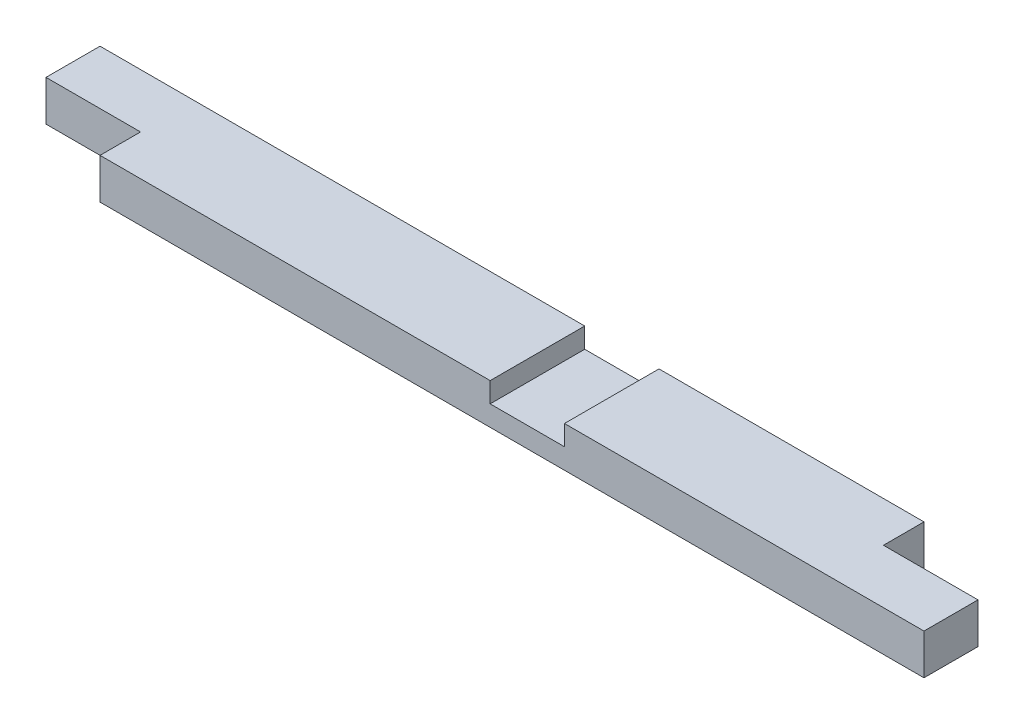
ISO-10303-21;
HEADER;
FILE_DESCRIPTION(('STEP AP214'),'2;1');
FILE_NAME('part.step','',(''),(''),'','','');
FILE_SCHEMA(('AUTOMOTIVE_DESIGN { 1 0 10303 214 1 1 1 1 }'));
ENDSEC;
DATA;
#1=APPLICATION_CONTEXT('core data for automotive mechanical design processes');
#2=APPLICATION_PROTOCOL_DEFINITION('international standard','automotive_design',2000,#1);
#3=PRODUCT_CONTEXT('',#1,'mechanical');
#4=PRODUCT('Part','Part','',(#3));
#5=PRODUCT_RELATED_PRODUCT_CATEGORY('part','',(#4));
#6=PRODUCT_DEFINITION_FORMATION('','',#4);
#7=PRODUCT_DEFINITION_CONTEXT('part definition',#1,'design');
#8=PRODUCT_DEFINITION('design','',#6,#7);
#9=PRODUCT_DEFINITION_SHAPE('','',#8);
#10=(LENGTH_UNIT() NAMED_UNIT(*) SI_UNIT(.MILLI.,.METRE.));
#11=(NAMED_UNIT(*) PLANE_ANGLE_UNIT() SI_UNIT($,.RADIAN.));
#12=(NAMED_UNIT(*) SI_UNIT($,.STERADIAN.) SOLID_ANGLE_UNIT());
#13=UNCERTAINTY_MEASURE_WITH_UNIT(LENGTH_MEASURE(1.E-05),#10,'distance_accuracy_value','');
#14=(GEOMETRIC_REPRESENTATION_CONTEXT(3) GLOBAL_UNCERTAINTY_ASSIGNED_CONTEXT((#13)) GLOBAL_UNIT_ASSIGNED_CONTEXT((#10,
#11,#12)) REPRESENTATION_CONTEXT('',''));
#15=CARTESIAN_POINT('',(0.,0.,0.));
#16=DIRECTION('',(0.,0.,1.));
#17=DIRECTION('',(1.,0.,0.));
#18=AXIS2_PLACEMENT_3D('',#15,#16,#17);
#19=CARTESIAN_POINT('',(0.,38.1,0.));
#20=DIRECTION('',(0.,-1.,0.));
#21=DIRECTION('',(0.,0.,-1.));
#22=AXIS2_PLACEMENT_3D('',#19,#20,#21);
#23=PLANE('',#22);
#24=DIRECTION('',(-1.,0.,0.));
#25=VECTOR('',#24,1.);
#26=CARTESIAN_POINT('',(0.,38.1,-88.9));
#27=LINE('',#26,#25);
#28=CARTESIAN_POINT('',(774.7,38.1,-88.9));
#29=VERTEX_POINT('',#28);
#30=CARTESIAN_POINT('',(525.573634290706,38.1,-88.9));
#31=VERTEX_POINT('',#30);
#32=EDGE_CURVE('E213',#29,#31,#27,.T.);
#33=ORIENTED_EDGE('',*,*,#32,.T.);
#34=DIRECTION('',(0.,0.,-1.));
#35=VECTOR('',#34,1.);
#36=CARTESIAN_POINT('',(525.573634290706,38.1,0.));
#37=LINE('',#36,#35);
#38=CARTESIAN_POINT('',(525.573634290706,38.1,0.));
#39=VERTEX_POINT('',#38);
#40=EDGE_CURVE('E162',#39,#31,#37,.T.);
#41=ORIENTED_EDGE('',*,*,#40,.F.);
#42=DIRECTION('',(1.,0.,0.));
#43=VECTOR('',#42,1.);
#44=CARTESIAN_POINT('',(0.,38.1,0.));
#45=LINE('',#44,#43);
#46=CARTESIAN_POINT('',(863.6,38.1,0.));
#47=VERTEX_POINT('',#46);
#48=EDGE_CURVE('E154',#39,#47,#45,.T.);
#49=ORIENTED_EDGE('',*,*,#48,.T.);
#50=DIRECTION('',(0.,0.,-1.));
#51=VECTOR('',#50,1.);
#52=CARTESIAN_POINT('',(863.6,38.1,0.));
#53=LINE('',#52,#51);
#54=CARTESIAN_POINT('',(863.6,38.1,-50.8));
#55=VERTEX_POINT('',#54);
#56=EDGE_CURVE('E209',#47,#55,#53,.T.);
#57=ORIENTED_EDGE('',*,*,#56,.T.);
#58=DIRECTION('',(-1.,0.,0.));
#59=VECTOR('',#58,1.);
#60=CARTESIAN_POINT('',(863.6,38.1,-50.8));
#61=LINE('',#60,#59);
#62=CARTESIAN_POINT('',(774.7,38.1,-50.8));
#63=VERTEX_POINT('',#62);
#64=EDGE_CURVE('E168',#55,#63,#61,.T.);
#65=ORIENTED_EDGE('',*,*,#64,.T.);
#66=DIRECTION('',(0.,0.,-1.));
#67=VECTOR('',#66,1.);
#68=CARTESIAN_POINT('',(774.7,38.1,-88.9));
#69=LINE('',#68,#67);
#70=EDGE_CURVE('E171',#63,#29,#69,.T.);
#71=ORIENTED_EDGE('',*,*,#70,.T.);
#72=EDGE_LOOP('',(#33,#41,#49,#57,#65,#71));
#73=FACE_BOUND('',#72,.T.);
#74=ADVANCED_FACE('F41',(#73),#23,.F.);
#75=CARTESIAN_POINT('',(0.,38.1,0.));
#76=DIRECTION('',(1.,0.,0.));
#77=DIRECTION('',(0.,0.,-1.));
#78=AXIS2_PLACEMENT_3D('',#75,#76,#77);
#79=PLANE('',#78);
#80=DIRECTION('',(0.,0.,1.));
#81=VECTOR('',#80,1.);
#82=CARTESIAN_POINT('',(0.,0.,0.));
#83=LINE('',#82,#81);
#84=CARTESIAN_POINT('',(0.,0.,-88.9));
#85=VERTEX_POINT('',#84);
#86=CARTESIAN_POINT('',(0.,0.,-38.1));
#87=VERTEX_POINT('',#86);
#88=EDGE_CURVE('E198',#85,#87,#83,.T.);
#89=ORIENTED_EDGE('',*,*,#88,.T.);
#90=DIRECTION('',(0.,1.,0.));
#91=VECTOR('',#90,1.);
#92=CARTESIAN_POINT('',(0.,0.,-38.1));
#93=LINE('',#92,#91);
#94=CARTESIAN_POINT('',(0.,38.1,-38.1));
#95=VERTEX_POINT('',#94);
#96=EDGE_CURVE('E195',#87,#95,#93,.T.);
#97=ORIENTED_EDGE('',*,*,#96,.T.);
#98=DIRECTION('',(0.,0.,1.));
#99=VECTOR('',#98,1.);
#100=CARTESIAN_POINT('',(0.,38.1,0.));
#101=LINE('',#100,#99);
#102=CARTESIAN_POINT('',(0.,38.1,-88.9));
#103=VERTEX_POINT('',#102);
#104=EDGE_CURVE('E202',#103,#95,#101,.T.);
#105=ORIENTED_EDGE('',*,*,#104,.F.);
#106=DIRECTION('',(0.,-1.,0.));
#107=VECTOR('',#106,1.);
#108=CARTESIAN_POINT('',(0.,38.1,-88.9));
#109=LINE('',#108,#107);
#110=EDGE_CURVE('E49',#103,#85,#109,.T.);
#111=ORIENTED_EDGE('',*,*,#110,.T.);
#112=EDGE_LOOP('',(#89,#97,#105,#111));
#113=FACE_BOUND('',#112,.T.);
#114=ADVANCED_FACE('F43',(#113),#79,.F.);
#115=CARTESIAN_POINT('',(0.,38.1,0.));
#116=DIRECTION('',(0.,0.,-1.));
#117=DIRECTION('',(-1.,0.,0.));
#118=AXIS2_PLACEMENT_3D('',#115,#116,#117);
#119=PLANE('',#118);
#120=ORIENTED_EDGE('',*,*,#48,.F.);
#121=DIRECTION('',(0.,-1.,0.));
#122=VECTOR('',#121,1.);
#123=CARTESIAN_POINT('',(525.573634290706,19.1544963612102,0.));
#124=LINE('',#123,#122);
#125=CARTESIAN_POINT('',(525.573634290706,19.1544963612102,0.));
#126=VERTEX_POINT('',#125);
#127=EDGE_CURVE('E134',#39,#126,#124,.T.);
#128=ORIENTED_EDGE('',*,*,#127,.T.);
#129=DIRECTION('',(-1.,0.,0.));
#130=VECTOR('',#129,1.);
#131=CARTESIAN_POINT('',(525.573634290706,19.1544963612102,0.));
#132=LINE('',#131,#130);
#133=CARTESIAN_POINT('',(455.723634290706,19.1544963612102,0.));
#134=VERTEX_POINT('',#133);
#135=EDGE_CURVE('E145',#126,#134,#132,.T.);
#136=ORIENTED_EDGE('',*,*,#135,.T.);
#137=DIRECTION('',(0.,1.,0.));
#138=VECTOR('',#137,1.);
#139=CARTESIAN_POINT('',(455.723634290706,19.1544963612102,0.));
#140=LINE('',#139,#138);
#141=CARTESIAN_POINT('',(455.723634290706,38.1,0.));
#142=VERTEX_POINT('',#141);
#143=EDGE_CURVE('E142',#134,#142,#140,.T.);
#144=ORIENTED_EDGE('',*,*,#143,.T.);
#145=CARTESIAN_POINT('',(88.9,38.1,0.));
#146=VERTEX_POINT('',#145);
#147=EDGE_CURVE('E206',#146,#142,#45,.T.);
#148=ORIENTED_EDGE('',*,*,#147,.F.);
#149=DIRECTION('',(0.,1.,0.));
#150=VECTOR('',#149,1.);
#151=CARTESIAN_POINT('',(88.9,0.,0.));
#152=LINE('',#151,#150);
#153=CARTESIAN_POINT('',(88.9,0.,0.));
#154=VERTEX_POINT('',#153);
#155=EDGE_CURVE('E191',#154,#146,#152,.T.);
#156=ORIENTED_EDGE('',*,*,#155,.F.);
#157=DIRECTION('',(1.,0.,0.));
#158=VECTOR('',#157,1.);
#159=CARTESIAN_POINT('',(0.,0.,0.));
#160=LINE('',#159,#158);
#161=CARTESIAN_POINT('',(863.6,0.,0.));
#162=VERTEX_POINT('',#161);
#163=EDGE_CURVE('E218',#154,#162,#160,.T.);
#164=ORIENTED_EDGE('',*,*,#163,.T.);
#165=DIRECTION('',(0.,-1.,0.));
#166=VECTOR('',#165,1.);
#167=CARTESIAN_POINT('',(863.6,38.1,0.));
#168=LINE('',#167,#166);
#169=EDGE_CURVE('E11',#47,#162,#168,.T.);
#170=ORIENTED_EDGE('',*,*,#169,.F.);
#171=EDGE_LOOP('',(#120,#128,#136,#144,#148,#156,#164,#170));
#172=FACE_BOUND('',#171,.T.);
#173=ADVANCED_FACE('F152',(#172),#119,.F.);
#174=CARTESIAN_POINT('',(863.6,38.1,0.));
#175=DIRECTION('',(-1.,0.,0.));
#176=DIRECTION('',(0.,0.,1.));
#177=AXIS2_PLACEMENT_3D('',#174,#175,#176);
#178=PLANE('',#177);
#179=DIRECTION('',(0.,0.,-1.));
#180=VECTOR('',#179,1.);
#181=CARTESIAN_POINT('',(863.6,0.,0.));
#182=LINE('',#181,#180);
#183=CARTESIAN_POINT('',(863.6,0.,-50.8));
#184=VERTEX_POINT('',#183);
#185=EDGE_CURVE('E220',#162,#184,#182,.T.);
#186=ORIENTED_EDGE('',*,*,#185,.T.);
#187=DIRECTION('',(0.,-1.,0.));
#188=VECTOR('',#187,1.);
#189=CARTESIAN_POINT('',(863.6,38.1,-50.8));
#190=LINE('',#189,#188);
#191=EDGE_CURVE('E64',#55,#184,#190,.T.);
#192=ORIENTED_EDGE('',*,*,#191,.F.);
#193=ORIENTED_EDGE('',*,*,#56,.F.);
#194=ORIENTED_EDGE('',*,*,#169,.T.);
#195=EDGE_LOOP('',(#186,#192,#193,#194));
#196=FACE_BOUND('',#195,.T.);
#197=ADVANCED_FACE('F254',(#196),#178,.F.);
#198=CARTESIAN_POINT('',(0.,38.1,-88.9));
#199=DIRECTION('',(0.,0.,1.));
#200=DIRECTION('',(1.,0.,0.));
#201=AXIS2_PLACEMENT_3D('',#198,#199,#200);
#202=PLANE('',#201);
#203=DIRECTION('',(-1.,0.,0.));
#204=VECTOR('',#203,1.);
#205=CARTESIAN_POINT('',(525.573634290706,19.1544963612102,-88.9));
#206=LINE('',#205,#204);
#207=CARTESIAN_POINT('',(525.573634290706,19.1544963612102,-88.9));
#208=VERTEX_POINT('',#207);
#209=CARTESIAN_POINT('',(455.723634290706,19.1544963612102,-88.9));
#210=VERTEX_POINT('',#209);
#211=EDGE_CURVE('E156',#208,#210,#206,.T.);
#212=ORIENTED_EDGE('',*,*,#211,.F.);
#213=DIRECTION('',(0.,-1.,0.));
#214=VECTOR('',#213,1.);
#215=CARTESIAN_POINT('',(525.573634290706,19.1544963612102,-88.9));
#216=LINE('',#215,#214);
#217=EDGE_CURVE('E137',#31,#208,#216,.T.);
#218=ORIENTED_EDGE('',*,*,#217,.F.);
#219=ORIENTED_EDGE('',*,*,#32,.F.);
#220=DIRECTION('',(0.,-1.,0.));
#221=VECTOR('',#220,1.);
#222=CARTESIAN_POINT('',(774.7,38.1,-88.9));
#223=LINE('',#222,#221);
#224=CARTESIAN_POINT('',(774.7,0.,-88.9));
#225=VERTEX_POINT('',#224);
#226=EDGE_CURVE('E177',#29,#225,#223,.T.);
#227=ORIENTED_EDGE('',*,*,#226,.T.);
#228=DIRECTION('',(-1.,0.,0.));
#229=VECTOR('',#228,1.);
#230=CARTESIAN_POINT('',(0.,0.,-88.9));
#231=LINE('',#230,#229);
#232=EDGE_CURVE('E205',#225,#85,#231,.T.);
#233=ORIENTED_EDGE('',*,*,#232,.T.);
#234=ORIENTED_EDGE('',*,*,#110,.F.);
#235=CARTESIAN_POINT('',(455.723634290706,38.1,-88.9));
#236=VERTEX_POINT('',#235);
#237=EDGE_CURVE('E212',#236,#103,#27,.T.);
#238=ORIENTED_EDGE('',*,*,#237,.F.);
#239=DIRECTION('',(0.,1.,0.));
#240=VECTOR('',#239,1.);
#241=CARTESIAN_POINT('',(455.723634290706,19.1544963612102,-88.9));
#242=LINE('',#241,#240);
#243=EDGE_CURVE('E56',#210,#236,#242,.T.);
#244=ORIENTED_EDGE('',*,*,#243,.F.);
#245=EDGE_LOOP('',(#212,#218,#219,#227,#233,#234,#238,#244));
#246=FACE_BOUND('',#245,.T.);
#247=ADVANCED_FACE('F246',(#246),#202,.F.);
#248=ORIENTED_EDGE('',*,*,#147,.T.);
#249=DIRECTION('',(0.,0.,-1.));
#250=VECTOR('',#249,1.);
#251=CARTESIAN_POINT('',(455.723634290706,38.1,0.));
#252=LINE('',#251,#250);
#253=EDGE_CURVE('E165',#142,#236,#252,.T.);
#254=ORIENTED_EDGE('',*,*,#253,.T.);
#255=ORIENTED_EDGE('',*,*,#237,.T.);
#256=ORIENTED_EDGE('',*,*,#104,.T.);
#257=DIRECTION('',(-1.,0.,0.));
#258=VECTOR('',#257,1.);
#259=CARTESIAN_POINT('',(0.,38.1,-38.1));
#260=LINE('',#259,#258);
#261=CARTESIAN_POINT('',(88.9,38.1,-38.1));
#262=VERTEX_POINT('',#261);
#263=EDGE_CURVE('E188',#262,#95,#260,.T.);
#264=ORIENTED_EDGE('',*,*,#263,.F.);
#265=DIRECTION('',(0.,0.,-1.));
#266=VECTOR('',#265,1.);
#267=CARTESIAN_POINT('',(88.9,38.1,0.));
#268=LINE('',#267,#266);
#269=EDGE_CURVE('E180',#146,#262,#268,.T.);
#270=ORIENTED_EDGE('',*,*,#269,.F.);
#271=EDGE_LOOP('',(#248,#254,#255,#256,#264,#270));
#272=FACE_BOUND('',#271,.T.);
#273=ADVANCED_FACE('F245',(#272),#23,.F.);
#274=CARTESIAN_POINT('',(0.,0.,0.));
#275=DIRECTION('',(0.,-1.,0.));
#276=DIRECTION('',(0.,0.,-1.));
#277=AXIS2_PLACEMENT_3D('',#274,#275,#276);
#278=PLANE('',#277);
#279=DIRECTION('',(0.,0.,-1.));
#280=VECTOR('',#279,1.);
#281=CARTESIAN_POINT('',(774.7,0.,-88.9));
#282=LINE('',#281,#280);
#283=CARTESIAN_POINT('',(774.7,0.,-50.8));
#284=VERTEX_POINT('',#283);
#285=EDGE_CURVE('E172',#284,#225,#282,.T.);
#286=ORIENTED_EDGE('',*,*,#285,.F.);
#287=DIRECTION('',(-1.,0.,0.));
#288=VECTOR('',#287,1.);
#289=CARTESIAN_POINT('',(863.6,0.,-50.8));
#290=LINE('',#289,#288);
#291=EDGE_CURVE('E164',#184,#284,#290,.T.);
#292=ORIENTED_EDGE('',*,*,#291,.F.);
#293=ORIENTED_EDGE('',*,*,#185,.F.);
#294=ORIENTED_EDGE('',*,*,#163,.F.);
#295=DIRECTION('',(0.,0.,-1.));
#296=VECTOR('',#295,1.);
#297=CARTESIAN_POINT('',(88.9,0.,0.));
#298=LINE('',#297,#296);
#299=CARTESIAN_POINT('',(88.9,0.,-38.1));
#300=VERTEX_POINT('',#299);
#301=EDGE_CURVE('E184',#154,#300,#298,.T.);
#302=ORIENTED_EDGE('',*,*,#301,.T.);
#303=DIRECTION('',(-1.,0.,0.));
#304=VECTOR('',#303,1.);
#305=CARTESIAN_POINT('',(0.,0.,-38.1));
#306=LINE('',#305,#304);
#307=EDGE_CURVE('E187',#300,#87,#306,.T.);
#308=ORIENTED_EDGE('',*,*,#307,.T.);
#309=ORIENTED_EDGE('',*,*,#88,.F.);
#310=ORIENTED_EDGE('',*,*,#232,.F.);
#311=EDGE_LOOP('',(#286,#292,#293,#294,#302,#308,#309,#310));
#312=FACE_BOUND('',#311,.T.);
#313=ADVANCED_FACE('F233',(#312),#278,.T.);
#314=CARTESIAN_POINT('',(0.,0.,-38.1));
#315=DIRECTION('',(0.,0.,-1.));
#316=DIRECTION('',(-1.,0.,0.));
#317=AXIS2_PLACEMENT_3D('',#314,#315,#316);
#318=PLANE('',#317);
#319=ORIENTED_EDGE('',*,*,#263,.T.);
#320=ORIENTED_EDGE('',*,*,#96,.F.);
#321=ORIENTED_EDGE('',*,*,#307,.F.);
#322=DIRECTION('',(0.,1.,0.));
#323=VECTOR('',#322,1.);
#324=CARTESIAN_POINT('',(88.9,0.,-38.1));
#325=LINE('',#324,#323);
#326=EDGE_CURVE('E199',#300,#262,#325,.T.);
#327=ORIENTED_EDGE('',*,*,#326,.T.);
#328=EDGE_LOOP('',(#319,#320,#321,#327));
#329=FACE_BOUND('',#328,.T.);
#330=ADVANCED_FACE('F237',(#329),#318,.F.);
#331=CARTESIAN_POINT('',(88.9,0.,0.));
#332=DIRECTION('',(1.,0.,0.));
#333=DIRECTION('',(0.,0.,-1.));
#334=AXIS2_PLACEMENT_3D('',#331,#332,#333);
#335=PLANE('',#334);
#336=ORIENTED_EDGE('',*,*,#269,.T.);
#337=ORIENTED_EDGE('',*,*,#326,.F.);
#338=ORIENTED_EDGE('',*,*,#301,.F.);
#339=ORIENTED_EDGE('',*,*,#155,.T.);
#340=EDGE_LOOP('',(#336,#337,#338,#339));
#341=FACE_BOUND('',#340,.T.);
#342=ADVANCED_FACE('F239',(#341),#335,.F.);
#343=CARTESIAN_POINT('',(774.7,38.1,-88.9));
#344=DIRECTION('',(-1.,0.,0.));
#345=DIRECTION('',(0.,0.,1.));
#346=AXIS2_PLACEMENT_3D('',#343,#344,#345);
#347=PLANE('',#346);
#348=ORIENTED_EDGE('',*,*,#285,.T.);
#349=ORIENTED_EDGE('',*,*,#226,.F.);
#350=ORIENTED_EDGE('',*,*,#70,.F.);
#351=DIRECTION('',(0.,-1.,0.));
#352=VECTOR('',#351,1.);
#353=CARTESIAN_POINT('',(774.7,38.1,-50.8));
#354=LINE('',#353,#352);
#355=EDGE_CURVE('E181',#63,#284,#354,.T.);
#356=ORIENTED_EDGE('',*,*,#355,.T.);
#357=EDGE_LOOP('',(#348,#349,#350,#356));
#358=FACE_BOUND('',#357,.T.);
#359=ADVANCED_FACE('F251',(#358),#347,.F.);
#360=CARTESIAN_POINT('',(863.6,38.1,-50.8));
#361=DIRECTION('',(0.,0.,1.));
#362=DIRECTION('',(1.,0.,0.));
#363=AXIS2_PLACEMENT_3D('',#360,#361,#362);
#364=PLANE('',#363);
#365=ORIENTED_EDGE('',*,*,#291,.T.);
#366=ORIENTED_EDGE('',*,*,#355,.F.);
#367=ORIENTED_EDGE('',*,*,#64,.F.);
#368=ORIENTED_EDGE('',*,*,#191,.T.);
#369=EDGE_LOOP('',(#365,#366,#367,#368));
#370=FACE_BOUND('',#369,.T.);
#371=ADVANCED_FACE('F264',(#370),#364,.F.);
#372=CARTESIAN_POINT('',(525.573634290706,19.1544963612102,0.));
#373=DIRECTION('',(1.,0.,0.));
#374=DIRECTION('',(0.,0.,-1.));
#375=AXIS2_PLACEMENT_3D('',#372,#373,#374);
#376=PLANE('',#375);
#377=ORIENTED_EDGE('',*,*,#217,.T.);
#378=DIRECTION('',(0.,0.,-1.));
#379=VECTOR('',#378,1.);
#380=CARTESIAN_POINT('',(525.573634290706,19.1544963612102,0.));
#381=LINE('',#380,#379);
#382=EDGE_CURVE('E130',#126,#208,#381,.T.);
#383=ORIENTED_EDGE('',*,*,#382,.F.);
#384=ORIENTED_EDGE('',*,*,#127,.F.);
#385=ORIENTED_EDGE('',*,*,#40,.T.);
#386=EDGE_LOOP('',(#377,#383,#384,#385));
#387=FACE_BOUND('',#386,.T.);
#388=ADVANCED_FACE('F132',(#387),#376,.F.);
#389=CARTESIAN_POINT('',(455.723634290706,19.1544963612102,0.));
#390=DIRECTION('',(-1.,0.,0.));
#391=DIRECTION('',(0.,0.,1.));
#392=AXIS2_PLACEMENT_3D('',#389,#390,#391);
#393=PLANE('',#392);
#394=ORIENTED_EDGE('',*,*,#243,.T.);
#395=ORIENTED_EDGE('',*,*,#253,.F.);
#396=ORIENTED_EDGE('',*,*,#143,.F.);
#397=DIRECTION('',(0.,0.,-1.));
#398=VECTOR('',#397,1.);
#399=CARTESIAN_POINT('',(455.723634290706,19.1544963612102,0.));
#400=LINE('',#399,#398);
#401=EDGE_CURVE('E141',#134,#210,#400,.T.);
#402=ORIENTED_EDGE('',*,*,#401,.T.);
#403=EDGE_LOOP('',(#394,#395,#396,#402));
#404=FACE_BOUND('',#403,.T.);
#405=ADVANCED_FACE('F256',(#404),#393,.F.);
#406=CARTESIAN_POINT('',(525.573634290706,19.1544963612102,0.));
#407=DIRECTION('',(0.,-1.,0.));
#408=DIRECTION('',(1.,0.,0.));
#409=AXIS2_PLACEMENT_3D('',#406,#407,#408);
#410=PLANE('',#409);
#411=ORIENTED_EDGE('',*,*,#211,.T.);
#412=ORIENTED_EDGE('',*,*,#401,.F.);
#413=ORIENTED_EDGE('',*,*,#135,.F.);
#414=ORIENTED_EDGE('',*,*,#382,.T.);
#415=EDGE_LOOP('',(#411,#412,#413,#414));
#416=FACE_BOUND('',#415,.T.);
#417=ADVANCED_FACE('F146',(#416),#410,.F.);
#418=CLOSED_SHELL('',(#74,#114,#173,#197,#247,#273,#313,#330,#342,#359,#371,#388,#405,#417));
#419=MANIFOLD_SOLID_BREP('B2',#418);
#420=ADVANCED_BREP_SHAPE_REPRESENTATION('',(#18,#419),#14);
#421=SHAPE_DEFINITION_REPRESENTATION(#9,#420);
ENDSEC;
END-ISO-10303-21;
